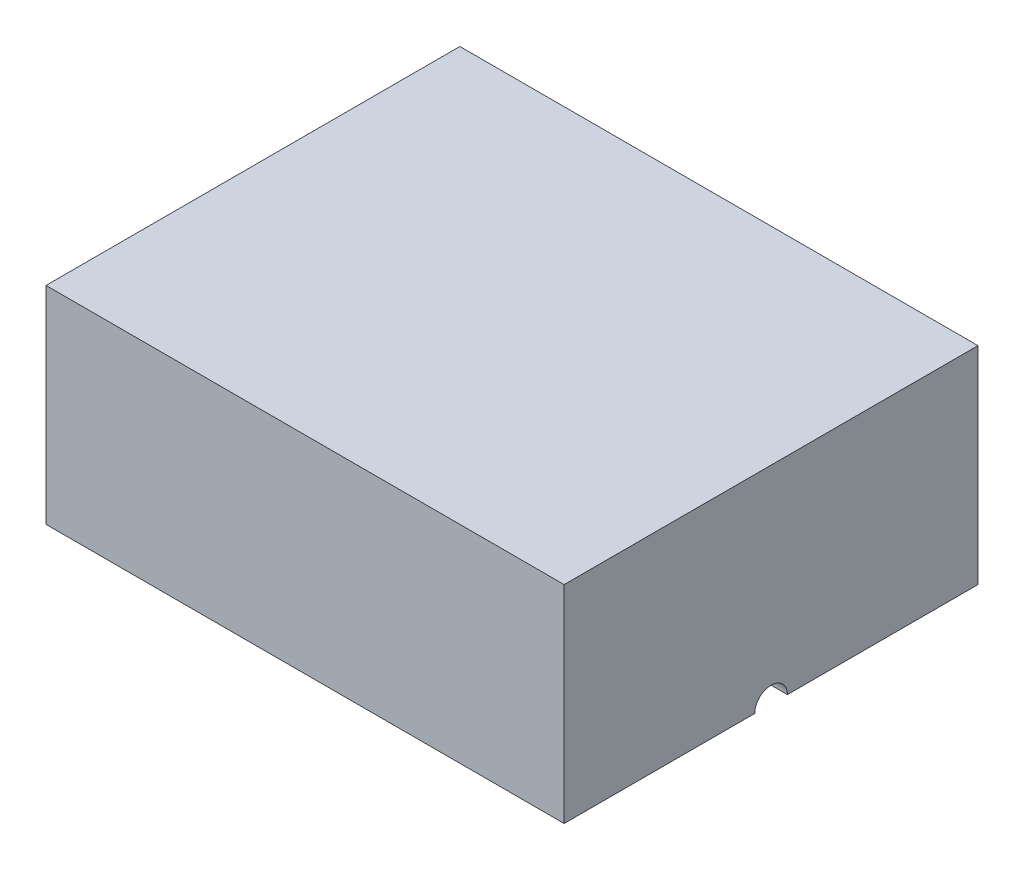
ISO-10303-21;
HEADER;
FILE_DESCRIPTION(('STEP AP214'),'2;1');
FILE_NAME('part.step','',(''),(''),'','','');
FILE_SCHEMA(('AUTOMOTIVE_DESIGN { 1 0 10303 214 1 1 1 1 }'));
ENDSEC;
DATA;
#1=APPLICATION_CONTEXT('core data for automotive mechanical design processes');
#2=APPLICATION_PROTOCOL_DEFINITION('international standard','automotive_design',2000,#1);
#3=PRODUCT_CONTEXT('',#1,'mechanical');
#4=PRODUCT('Part','Part','',(#3));
#5=PRODUCT_RELATED_PRODUCT_CATEGORY('part','',(#4));
#6=PRODUCT_DEFINITION_FORMATION('','',#4);
#7=PRODUCT_DEFINITION_CONTEXT('part definition',#1,'design');
#8=PRODUCT_DEFINITION('design','',#6,#7);
#9=PRODUCT_DEFINITION_SHAPE('','',#8);
#10=(LENGTH_UNIT() NAMED_UNIT(*) SI_UNIT(.MILLI.,.METRE.));
#11=(NAMED_UNIT(*) PLANE_ANGLE_UNIT() SI_UNIT($,.RADIAN.));
#12=(NAMED_UNIT(*) SI_UNIT($,.STERADIAN.) SOLID_ANGLE_UNIT());
#13=UNCERTAINTY_MEASURE_WITH_UNIT(LENGTH_MEASURE(1.E-05),#10,'distance_accuracy_value','');
#14=(GEOMETRIC_REPRESENTATION_CONTEXT(3) GLOBAL_UNCERTAINTY_ASSIGNED_CONTEXT((#13)) GLOBAL_UNIT_ASSIGNED_CONTEXT((#10,
#11,#12)) REPRESENTATION_CONTEXT('',''));
#15=CARTESIAN_POINT('',(0.,0.,0.));
#16=DIRECTION('',(0.,0.,1.));
#17=DIRECTION('',(1.,0.,0.));
#18=AXIS2_PLACEMENT_3D('',#15,#16,#17);
#19=CARTESIAN_POINT('',(0.,0.,0.));
#20=DIRECTION('',(0.,-1.,0.));
#21=DIRECTION('',(0.,0.,-1.));
#22=AXIS2_PLACEMENT_3D('',#19,#20,#21);
#23=PLANE('',#22);
#24=DIRECTION('',(1.,0.,0.));
#25=VECTOR('',#24,1.);
#26=CARTESIAN_POINT('',(-15.9,0.,-0.999999999999991));
#27=LINE('',#26,#25);
#28=CARTESIAN_POINT('',(-15.9,0.,-0.999999999999991));
#29=VERTEX_POINT('',#28);
#30=CARTESIAN_POINT('',(-13.9202130863005,0.,-0.999999999999993));
#31=VERTEX_POINT('',#30);
#32=EDGE_CURVE('E56',#29,#31,#27,.T.);
#33=ORIENTED_EDGE('',*,*,#32,.F.);
#34=DIRECTION('',(0.,0.,1.));
#35=VECTOR('',#34,1.);
#36=CARTESIAN_POINT('',(-15.9,0.,-12.7));
#37=LINE('',#36,#35);
#38=CARTESIAN_POINT('',(-15.9,0.,-12.7));
#39=VERTEX_POINT('',#38);
#40=EDGE_CURVE('E109',#39,#29,#37,.T.);
#41=ORIENTED_EDGE('',*,*,#40,.F.);
#42=DIRECTION('',(-1.,0.,0.));
#43=VECTOR('',#42,1.);
#44=CARTESIAN_POINT('',(15.9,0.,-12.7));
#45=LINE('',#44,#43);
#46=CARTESIAN_POINT('',(15.9,0.,-12.7));
#47=VERTEX_POINT('',#46);
#48=EDGE_CURVE('E131',#47,#39,#45,.T.);
#49=ORIENTED_EDGE('',*,*,#48,.F.);
#50=DIRECTION('',(0.,0.,-1.));
#51=VECTOR('',#50,1.);
#52=CARTESIAN_POINT('',(15.9,0.,-12.7));
#53=LINE('',#52,#51);
#54=CARTESIAN_POINT('',(15.9,0.,-1.00000000000001));
#55=VERTEX_POINT('',#54);
#56=EDGE_CURVE('E122',#55,#47,#53,.T.);
#57=ORIENTED_EDGE('',*,*,#56,.F.);
#58=CARTESIAN_POINT('',(13.9202130863005,0.,-1.00000000000001));
#59=VERTEX_POINT('',#58);
#60=EDGE_CURVE('E115',#59,#55,#27,.T.);
#61=ORIENTED_EDGE('',*,*,#60,.F.);
#62=CARTESIAN_POINT('',(0.,0.,0.));
#63=DIRECTION('',(0.,1.,0.));
#64=DIRECTION('',(1.,0.,0.));
#65=AXIS2_PLACEMENT_3D('',#62,#63,#64);
#66=ELLIPSE('',#65,14.,9.38);
#67=EDGE_CURVE('E112',#59,#31,#66,.T.);
#68=ORIENTED_EDGE('',*,*,#67,.T.);
#69=EDGE_LOOP('',(#33,#41,#49,#57,#61,#68));
#70=FACE_BOUND('',#69,.T.);
#71=ADVANCED_FACE('F34',(#70),#23,.T.);
#72=CARTESIAN_POINT('',(-15.9,12.7,-12.7));
#73=DIRECTION('',(1.,0.,0.));
#74=DIRECTION('',(0.,0.,-1.));
#75=AXIS2_PLACEMENT_3D('',#72,#73,#74);
#76=PLANE('',#75);
#77=ORIENTED_EDGE('',*,*,#40,.T.);
#78=CARTESIAN_POINT('',(-15.9,0.,0.));
#79=DIRECTION('',(1.,0.,0.));
#80=DIRECTION('',(0.,0.,-1.));
#81=AXIS2_PLACEMENT_3D('',#78,#79,#80);
#82=CIRCLE('',#81,1.);
#83=CARTESIAN_POINT('',(-15.9,0.,1.00000000000001));
#84=VERTEX_POINT('',#83);
#85=EDGE_CURVE('E96',#29,#84,#82,.T.);
#86=ORIENTED_EDGE('',*,*,#85,.T.);
#87=CARTESIAN_POINT('',(-15.9,0.,12.7));
#88=VERTEX_POINT('',#87);
#89=EDGE_CURVE('E113',#84,#88,#37,.T.);
#90=ORIENTED_EDGE('',*,*,#89,.T.);
#91=DIRECTION('',(0.,-1.,0.));
#92=VECTOR('',#91,1.);
#93=CARTESIAN_POINT('',(-15.9,12.7,12.7));
#94=LINE('',#93,#92);
#95=CARTESIAN_POINT('',(-15.9,12.7,12.7));
#96=VERTEX_POINT('',#95);
#97=EDGE_CURVE('E141',#96,#88,#94,.T.);
#98=ORIENTED_EDGE('',*,*,#97,.F.);
#99=DIRECTION('',(0.,0.,1.));
#100=VECTOR('',#99,1.);
#101=CARTESIAN_POINT('',(-15.9,12.7,-12.7));
#102=LINE('',#101,#100);
#103=CARTESIAN_POINT('',(-15.9,12.7,-12.7));
#104=VERTEX_POINT('',#103);
#105=EDGE_CURVE('E133',#104,#96,#102,.T.);
#106=ORIENTED_EDGE('',*,*,#105,.F.);
#107=DIRECTION('',(0.,-1.,0.));
#108=VECTOR('',#107,1.);
#109=CARTESIAN_POINT('',(-15.9,12.7,-12.7));
#110=LINE('',#109,#108);
#111=EDGE_CURVE('E119',#104,#39,#110,.T.);
#112=ORIENTED_EDGE('',*,*,#111,.T.);
#113=EDGE_LOOP('',(#77,#86,#90,#98,#106,#112));
#114=FACE_BOUND('',#113,.T.);
#115=ADVANCED_FACE('F36',(#114),#76,.F.);
#116=CARTESIAN_POINT('',(15.9,12.7,12.7));
#117=DIRECTION('',(0.,0.,-1.));
#118=DIRECTION('',(-1.,0.,0.));
#119=AXIS2_PLACEMENT_3D('',#116,#117,#118);
#120=PLANE('',#119);
#121=DIRECTION('',(1.,0.,0.));
#122=VECTOR('',#121,1.);
#123=CARTESIAN_POINT('',(15.9,0.,12.7));
#124=LINE('',#123,#122);
#125=CARTESIAN_POINT('',(15.9,0.,12.7));
#126=VERTEX_POINT('',#125);
#127=EDGE_CURVE('E120',#88,#126,#124,.T.);
#128=ORIENTED_EDGE('',*,*,#127,.T.);
#129=DIRECTION('',(0.,-1.,0.));
#130=VECTOR('',#129,1.);
#131=CARTESIAN_POINT('',(15.9,12.7,12.7));
#132=LINE('',#131,#130);
#133=CARTESIAN_POINT('',(15.9,12.7,12.7));
#134=VERTEX_POINT('',#133);
#135=EDGE_CURVE('E138',#134,#126,#132,.T.);
#136=ORIENTED_EDGE('',*,*,#135,.F.);
#137=DIRECTION('',(1.,0.,0.));
#138=VECTOR('',#137,1.);
#139=CARTESIAN_POINT('',(15.9,12.7,12.7));
#140=LINE('',#139,#138);
#141=EDGE_CURVE('E256',#96,#134,#140,.T.);
#142=ORIENTED_EDGE('',*,*,#141,.F.);
#143=ORIENTED_EDGE('',*,*,#97,.T.);
#144=EDGE_LOOP('',(#128,#136,#142,#143));
#145=FACE_BOUND('',#144,.T.);
#146=ADVANCED_FACE('F178',(#145),#120,.F.);
#147=CARTESIAN_POINT('',(15.9,12.7,-12.7));
#148=DIRECTION('',(-1.,0.,0.));
#149=DIRECTION('',(0.,0.,1.));
#150=AXIS2_PLACEMENT_3D('',#147,#148,#149);
#151=PLANE('',#150);
#152=CARTESIAN_POINT('',(15.9,0.,0.999999999999991));
#153=VERTEX_POINT('',#152);
#154=EDGE_CURVE('E128',#126,#153,#53,.T.);
#155=ORIENTED_EDGE('',*,*,#154,.T.);
#156=CARTESIAN_POINT('',(15.9,0.,0.));
#157=DIRECTION('',(1.,0.,0.));
#158=DIRECTION('',(0.,0.,-1.));
#159=AXIS2_PLACEMENT_3D('',#156,#157,#158);
#160=CIRCLE('',#159,1.);
#161=EDGE_CURVE('E103',#55,#153,#160,.T.);
#162=ORIENTED_EDGE('',*,*,#161,.F.);
#163=ORIENTED_EDGE('',*,*,#56,.T.);
#164=DIRECTION('',(0.,-1.,0.));
#165=VECTOR('',#164,1.);
#166=CARTESIAN_POINT('',(15.9,12.7,-12.7));
#167=LINE('',#166,#165);
#168=CARTESIAN_POINT('',(15.9,12.7,-12.7));
#169=VERTEX_POINT('',#168);
#170=EDGE_CURVE('E135',#169,#47,#167,.T.);
#171=ORIENTED_EDGE('',*,*,#170,.F.);
#172=DIRECTION('',(0.,0.,-1.));
#173=VECTOR('',#172,1.);
#174=CARTESIAN_POINT('',(15.9,12.7,-12.7));
#175=LINE('',#174,#173);
#176=EDGE_CURVE('E254',#134,#169,#175,.T.);
#177=ORIENTED_EDGE('',*,*,#176,.F.);
#178=ORIENTED_EDGE('',*,*,#135,.T.);
#179=EDGE_LOOP('',(#155,#162,#163,#171,#177,#178));
#180=FACE_BOUND('',#179,.T.);
#181=ADVANCED_FACE('F175',(#180),#151,.F.);
#182=CARTESIAN_POINT('',(15.9,12.7,-12.7));
#183=DIRECTION('',(0.,0.,1.));
#184=DIRECTION('',(1.,0.,0.));
#185=AXIS2_PLACEMENT_3D('',#182,#183,#184);
#186=PLANE('',#185);
#187=ORIENTED_EDGE('',*,*,#48,.T.);
#188=ORIENTED_EDGE('',*,*,#111,.F.);
#189=DIRECTION('',(-1.,0.,0.));
#190=VECTOR('',#189,1.);
#191=CARTESIAN_POINT('',(15.9,12.7,-12.7));
#192=LINE('',#191,#190);
#193=EDGE_CURVE('E125',#169,#104,#192,.T.);
#194=ORIENTED_EDGE('',*,*,#193,.F.);
#195=ORIENTED_EDGE('',*,*,#170,.T.);
#196=EDGE_LOOP('',(#187,#188,#194,#195));
#197=FACE_BOUND('',#196,.T.);
#198=ADVANCED_FACE('F169',(#197),#186,.F.);
#199=CARTESIAN_POINT('',(0.,12.7,0.));
#200=DIRECTION('',(0.,-1.,0.));
#201=DIRECTION('',(0.,0.,-1.));
#202=AXIS2_PLACEMENT_3D('',#199,#200,#201);
#203=PLANE('',#202);
#204=ORIENTED_EDGE('',*,*,#105,.T.);
#205=ORIENTED_EDGE('',*,*,#141,.T.);
#206=ORIENTED_EDGE('',*,*,#176,.T.);
#207=ORIENTED_EDGE('',*,*,#193,.T.);
#208=EDGE_LOOP('',(#204,#205,#206,#207));
#209=FACE_BOUND('',#208,.T.);
#210=ADVANCED_FACE('F166',(#209),#203,.F.);
#211=DIRECTION('',(1.,0.,0.));
#212=VECTOR('',#211,1.);
#213=CARTESIAN_POINT('',(-15.9,0.,1.00000000000001));
#214=LINE('',#213,#212);
#215=CARTESIAN_POINT('',(13.9202130863005,0.,1.));
#216=VERTEX_POINT('',#215);
#217=EDGE_CURVE('E49',#153,#216,#214,.F.);
#218=ORIENTED_EDGE('',*,*,#217,.F.);
#219=ORIENTED_EDGE('',*,*,#154,.F.);
#220=ORIENTED_EDGE('',*,*,#127,.F.);
#221=ORIENTED_EDGE('',*,*,#89,.F.);
#222=CARTESIAN_POINT('',(-13.9202130863005,0.,1.));
#223=VERTEX_POINT('',#222);
#224=EDGE_CURVE('E99',#223,#84,#214,.F.);
#225=ORIENTED_EDGE('',*,*,#224,.F.);
#226=CARTESIAN_POINT('',(0.,0.,0.));
#227=DIRECTION('',(0.,-1.,0.));
#228=DIRECTION('',(1.,0.,0.));
#229=AXIS2_PLACEMENT_3D('',#226,#227,#228);
#230=ELLIPSE('',#229,14.,9.38);
#231=EDGE_CURVE('E145',#223,#216,#230,.F.);
#232=ORIENTED_EDGE('',*,*,#231,.T.);
#233=EDGE_LOOP('',(#218,#219,#220,#221,#225,#232));
#234=FACE_BOUND('',#233,.T.);
#235=ADVANCED_FACE('F154',(#234),#23,.T.);
#236=CARTESIAN_POINT('',(0.,0.,0.));
#237=DIRECTION('',(0.,1.,0.));
#238=DIRECTION('',(1.,0.,0.));
#239=AXIS2_PLACEMENT_3D('',#236,#237,#238);
#240=ELLIPSE('',#239,14.,9.38);
#241=TRIMMED_CURVE('',#240,(PARAMETER_VALUE(0.)),(PARAMETER_VALUE(3.14159265358979)),.T.,.PARAMETER.);
#242=CARTESIAN_POINT('',(0.,0.,0.));
#243=DIRECTION('',(-1.,0.,0.));
#244=AXIS1_PLACEMENT('',#242,#243);
#245=SURFACE_OF_REVOLUTION('',#241,#244);
#246=CARTESIAN_POINT('',(-13.9202130863005,0.,0.));
#247=DIRECTION('',(-1.,0.,0.));
#248=DIRECTION('',(0.,0.,1.));
#249=AXIS2_PLACEMENT_3D('',#246,#247,#248);
#250=CIRCLE('',#249,1.);
#251=EDGE_CURVE('E11',#31,#223,#250,.F.);
#252=ORIENTED_EDGE('',*,*,#251,.F.);
#253=ORIENTED_EDGE('',*,*,#67,.F.);
#254=CARTESIAN_POINT('',(13.9202130863005,0.,0.));
#255=DIRECTION('',(-1.,0.,0.));
#256=DIRECTION('',(0.,0.,1.));
#257=AXIS2_PLACEMENT_3D('',#254,#255,#256);
#258=CIRCLE('',#257,1.);
#259=EDGE_CURVE('E42',#216,#59,#258,.T.);
#260=ORIENTED_EDGE('',*,*,#259,.F.);
#261=ORIENTED_EDGE('',*,*,#231,.F.);
#262=EDGE_LOOP('',(#252,#253,#260,#261));
#263=FACE_BOUND('',#262,.T.);
#264=ADVANCED_FACE('F152',(#263),#245,.F.);
#265=CARTESIAN_POINT('',(-15.9,0.,0.));
#266=DIRECTION('',(1.,0.,0.));
#267=DIRECTION('',(0.,0.,-1.));
#268=AXIS2_PLACEMENT_3D('',#265,#266,#267);
#269=CYLINDRICAL_SURFACE('',#268,1.);
#270=ORIENTED_EDGE('',*,*,#60,.T.);
#271=ORIENTED_EDGE('',*,*,#161,.T.);
#272=ORIENTED_EDGE('',*,*,#217,.T.);
#273=ORIENTED_EDGE('',*,*,#259,.T.);
#274=EDGE_LOOP('',(#270,#271,#272,#273));
#275=FACE_BOUND('',#274,.T.);
#276=ADVANCED_FACE('F147',(#275),#269,.F.);
#277=ORIENTED_EDGE('',*,*,#32,.T.);
#278=ORIENTED_EDGE('',*,*,#251,.T.);
#279=ORIENTED_EDGE('',*,*,#224,.T.);
#280=ORIENTED_EDGE('',*,*,#85,.F.);
#281=EDGE_LOOP('',(#277,#278,#279,#280));
#282=FACE_BOUND('',#281,.T.);
#283=ADVANCED_FACE('F97',(#282),#269,.F.);
#284=CLOSED_SHELL('',(#71,#115,#146,#181,#198,#210,#235,#264,#276,#283));
#285=MANIFOLD_SOLID_BREP('B2',#284);
#286=ADVANCED_BREP_SHAPE_REPRESENTATION('',(#18,#285),#14);
#287=SHAPE_DEFINITION_REPRESENTATION(#9,#286);
ENDSEC;
END-ISO-10303-21;
